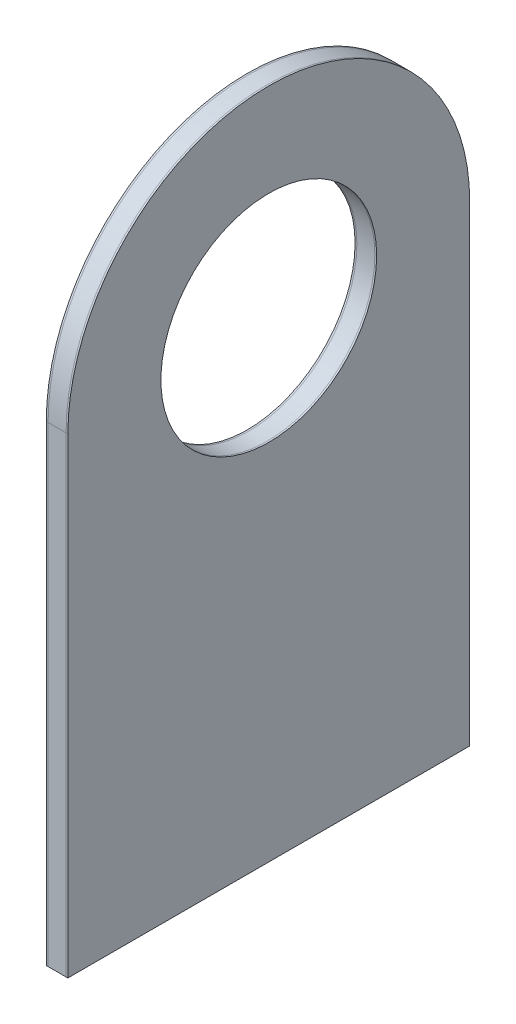
ISO-10303-21;
HEADER;
FILE_DESCRIPTION(('STEP AP214'),'2;1');
FILE_NAME('part.step','',(''),(''),'','','');
FILE_SCHEMA(('AUTOMOTIVE_DESIGN { 1 0 10303 214 1 1 1 1 }'));
ENDSEC;
DATA;
#1=APPLICATION_CONTEXT('core data for automotive mechanical design processes');
#2=APPLICATION_PROTOCOL_DEFINITION('international standard','automotive_design',2000,#1);
#3=PRODUCT_CONTEXT('',#1,'mechanical');
#4=PRODUCT('Part','Part','',(#3));
#5=PRODUCT_RELATED_PRODUCT_CATEGORY('part','',(#4));
#6=PRODUCT_DEFINITION_FORMATION('','',#4);
#7=PRODUCT_DEFINITION_CONTEXT('part definition',#1,'design');
#8=PRODUCT_DEFINITION('design','',#6,#7);
#9=PRODUCT_DEFINITION_SHAPE('','',#8);
#10=(LENGTH_UNIT() NAMED_UNIT(*) SI_UNIT(.MILLI.,.METRE.));
#11=(NAMED_UNIT(*) PLANE_ANGLE_UNIT() SI_UNIT($,.RADIAN.));
#12=(NAMED_UNIT(*) SI_UNIT($,.STERADIAN.) SOLID_ANGLE_UNIT());
#13=UNCERTAINTY_MEASURE_WITH_UNIT(LENGTH_MEASURE(1.E-05),#10,'distance_accuracy_value','');
#14=(GEOMETRIC_REPRESENTATION_CONTEXT(3) GLOBAL_UNCERTAINTY_ASSIGNED_CONTEXT((#13)) GLOBAL_UNIT_ASSIGNED_CONTEXT((#10,
#11,#12)) REPRESENTATION_CONTEXT('',''));
#15=CARTESIAN_POINT('',(0.,0.,0.));
#16=DIRECTION('',(0.,0.,1.));
#17=DIRECTION('',(1.,0.,0.));
#18=AXIS2_PLACEMENT_3D('',#15,#16,#17);
#19=CARTESIAN_POINT('',(3.,0.,0.));
#20=DIRECTION('',(0.,1.,0.));
#21=DIRECTION('',(0.,0.,1.));
#22=AXIS2_PLACEMENT_3D('',#19,#20,#21);
#23=PLANE('',#22);
#24=DIRECTION('',(0.,0.,-1.));
#25=VECTOR('',#24,1.);
#26=CARTESIAN_POINT('',(2.75,0.,0.));
#27=LINE('',#26,#25);
#28=CARTESIAN_POINT('',(2.75,0.,27.94));
#29=VERTEX_POINT('',#28);
#30=CARTESIAN_POINT('',(2.75,0.,-27.94));
#31=VERTEX_POINT('',#30);
#32=EDGE_CURVE('E127',#29,#31,#27,.T.);
#33=ORIENTED_EDGE('',*,*,#32,.T.);
#34=DIRECTION('',(-1.,0.,0.));
#35=VECTOR('',#34,1.);
#36=CARTESIAN_POINT('',(3.,0.,-27.94));
#37=LINE('',#36,#35);
#38=CARTESIAN_POINT('',(3.,0.,-27.94));
#39=VERTEX_POINT('',#38);
#40=EDGE_CURVE('E12',#39,#31,#37,.T.);
#41=ORIENTED_EDGE('',*,*,#40,.F.);
#42=DIRECTION('',(0.,0.,-1.));
#43=VECTOR('',#42,1.);
#44=CARTESIAN_POINT('',(3.,0.,0.));
#45=LINE('',#44,#43);
#46=CARTESIAN_POINT('',(3.,0.,27.94));
#47=VERTEX_POINT('',#46);
#48=EDGE_CURVE('E112',#47,#39,#45,.T.);
#49=ORIENTED_EDGE('',*,*,#48,.F.);
#50=DIRECTION('',(-1.,0.,0.));
#51=VECTOR('',#50,1.);
#52=CARTESIAN_POINT('',(3.,0.,27.94));
#53=LINE('',#52,#51);
#54=EDGE_CURVE('E126',#47,#29,#53,.T.);
#55=ORIENTED_EDGE('',*,*,#54,.T.);
#56=EDGE_LOOP('',(#33,#41,#49,#55));
#57=FACE_BOUND('',#56,.T.);
#58=ADVANCED_FACE('F60',(#57),#23,.F.);
#59=CARTESIAN_POINT('',(3.,0.,-27.94));
#60=DIRECTION('',(0.,0.,1.));
#61=DIRECTION('',(1.,0.,0.));
#62=AXIS2_PLACEMENT_3D('',#59,#60,#61);
#63=PLANE('',#62);
#64=DIRECTION('',(0.,1.,0.));
#65=VECTOR('',#64,1.);
#66=CARTESIAN_POINT('',(2.75,0.,-27.94));
#67=LINE('',#66,#65);
#68=CARTESIAN_POINT('',(2.75,65.532,-27.94));
#69=VERTEX_POINT('',#68);
#70=EDGE_CURVE('E116',#31,#69,#67,.T.);
#71=ORIENTED_EDGE('',*,*,#70,.T.);
#72=DIRECTION('',(-1.,0.,0.));
#73=VECTOR('',#72,1.);
#74=CARTESIAN_POINT('',(3.,65.532,-27.94));
#75=LINE('',#74,#73);
#76=CARTESIAN_POINT('',(3.,65.532,-27.94));
#77=VERTEX_POINT('',#76);
#78=EDGE_CURVE('E68',#77,#69,#75,.T.);
#79=ORIENTED_EDGE('',*,*,#78,.F.);
#80=DIRECTION('',(0.,1.,0.));
#81=VECTOR('',#80,1.);
#82=CARTESIAN_POINT('',(3.,0.,-27.94));
#83=LINE('',#82,#81);
#84=EDGE_CURVE('E106',#39,#77,#83,.T.);
#85=ORIENTED_EDGE('',*,*,#84,.F.);
#86=ORIENTED_EDGE('',*,*,#40,.T.);
#87=EDGE_LOOP('',(#71,#79,#85,#86));
#88=FACE_BOUND('',#87,.T.);
#89=ADVANCED_FACE('F115',(#88),#63,.F.);
#90=CARTESIAN_POINT('',(3.,65.532,0.));
#91=DIRECTION('',(-1.,0.,0.));
#92=DIRECTION('',(0.,0.,1.));
#93=AXIS2_PLACEMENT_3D('',#90,#91,#92);
#94=CYLINDRICAL_SURFACE('',#93,27.94);
#95=CARTESIAN_POINT('',(2.75,65.532,0.));
#96=DIRECTION('',(1.,0.,0.));
#97=DIRECTION('',(0.,0.,-1.));
#98=AXIS2_PLACEMENT_3D('',#95,#96,#97);
#99=CIRCLE('',#98,27.94);
#100=CARTESIAN_POINT('',(2.75,65.532,27.94));
#101=VERTEX_POINT('',#100);
#102=EDGE_CURVE('E93',#69,#101,#99,.T.);
#103=ORIENTED_EDGE('',*,*,#102,.T.);
#104=DIRECTION('',(-1.,0.,0.));
#105=VECTOR('',#104,1.);
#106=CARTESIAN_POINT('',(3.,65.532,27.94));
#107=LINE('',#106,#105);
#108=CARTESIAN_POINT('',(3.,65.532,27.94));
#109=VERTEX_POINT('',#108);
#110=EDGE_CURVE('E117',#109,#101,#107,.T.);
#111=ORIENTED_EDGE('',*,*,#110,.F.);
#112=CARTESIAN_POINT('',(3.,65.532,0.));
#113=DIRECTION('',(1.,0.,0.));
#114=DIRECTION('',(0.,0.,-1.));
#115=AXIS2_PLACEMENT_3D('',#112,#113,#114);
#116=CIRCLE('',#115,27.94);
#117=EDGE_CURVE('E110',#77,#109,#116,.T.);
#118=ORIENTED_EDGE('',*,*,#117,.F.);
#119=ORIENTED_EDGE('',*,*,#78,.T.);
#120=EDGE_LOOP('',(#103,#111,#118,#119));
#121=FACE_BOUND('',#120,.T.);
#122=ADVANCED_FACE('F118',(#121),#94,.T.);
#123=CARTESIAN_POINT('',(3.,0.,27.94));
#124=DIRECTION('',(0.,0.,-1.));
#125=DIRECTION('',(-1.,0.,0.));
#126=AXIS2_PLACEMENT_3D('',#123,#124,#125);
#127=PLANE('',#126);
#128=DIRECTION('',(0.,-1.,0.));
#129=VECTOR('',#128,1.);
#130=CARTESIAN_POINT('',(2.75,0.,27.94));
#131=LINE('',#130,#129);
#132=EDGE_CURVE('E99',#101,#29,#131,.T.);
#133=ORIENTED_EDGE('',*,*,#132,.T.);
#134=ORIENTED_EDGE('',*,*,#54,.F.);
#135=DIRECTION('',(0.,-1.,0.));
#136=VECTOR('',#135,1.);
#137=CARTESIAN_POINT('',(3.,0.,27.94));
#138=LINE('',#137,#136);
#139=EDGE_CURVE('E76',#109,#47,#138,.T.);
#140=ORIENTED_EDGE('',*,*,#139,.F.);
#141=ORIENTED_EDGE('',*,*,#110,.T.);
#142=EDGE_LOOP('',(#133,#134,#140,#141));
#143=FACE_BOUND('',#142,.T.);
#144=ADVANCED_FACE('F137',(#143),#127,.F.);
#145=CARTESIAN_POINT('',(3.,65.532,0.));
#146=DIRECTION('',(-1.,0.,0.));
#147=DIRECTION('',(0.,0.,1.));
#148=AXIS2_PLACEMENT_3D('',#145,#146,#147);
#149=CYLINDRICAL_SURFACE('',#148,15.);
#150=CARTESIAN_POINT('',(3.,65.532,0.));
#151=DIRECTION('',(1.,0.,0.));
#152=DIRECTION('',(0.,0.,-1.));
#153=AXIS2_PLACEMENT_3D('',#150,#151,#152);
#154=CIRCLE('',#153,15.);
#155=CARTESIAN_POINT('',(3.,65.532,-15.));
#156=VERTEX_POINT('',#155);
#157=EDGE_CURVE('E120',#156,#156,#154,.F.);
#158=ORIENTED_EDGE('',*,*,#157,.F.);
#159=EDGE_LOOP('',(#158));
#160=FACE_BOUND('',#159,.T.);
#161=CARTESIAN_POINT('',(2.75,65.532,0.));
#162=DIRECTION('',(1.,0.,0.));
#163=DIRECTION('',(0.,0.,-1.));
#164=AXIS2_PLACEMENT_3D('',#161,#162,#163);
#165=CIRCLE('',#164,15.);
#166=CARTESIAN_POINT('',(2.75,65.532,-15.));
#167=VERTEX_POINT('',#166);
#168=EDGE_CURVE('E133',#167,#167,#165,.F.);
#169=ORIENTED_EDGE('',*,*,#168,.T.);
#170=EDGE_LOOP('',(#169));
#171=FACE_BOUND('',#170,.T.);
#172=ADVANCED_FACE('F154',(#160,#171),#149,.F.);
#173=CARTESIAN_POINT('',(3.,0.,0.));
#174=DIRECTION('',(1.,0.,0.));
#175=DIRECTION('',(0.,0.,-1.));
#176=AXIS2_PLACEMENT_3D('',#173,#174,#175);
#177=PLANE('',#176);
#178=ORIENTED_EDGE('',*,*,#48,.T.);
#179=ORIENTED_EDGE('',*,*,#84,.T.);
#180=ORIENTED_EDGE('',*,*,#117,.T.);
#181=ORIENTED_EDGE('',*,*,#139,.T.);
#182=EDGE_LOOP('',(#178,#179,#180,#181));
#183=FACE_BOUND('',#182,.T.);
#184=ORIENTED_EDGE('',*,*,#157,.T.);
#185=EDGE_LOOP('',(#184));
#186=FACE_BOUND('',#185,.T.);
#187=ADVANCED_FACE('F107',(#183,#186),#177,.T.);
#188=CARTESIAN_POINT('',(2.75,0.,0.));
#189=DIRECTION('',(1.,0.,0.));
#190=DIRECTION('',(0.,0.,-1.));
#191=AXIS2_PLACEMENT_3D('',#188,#189,#190);
#192=PLANE('',#191);
#193=ORIENTED_EDGE('',*,*,#32,.F.);
#194=ORIENTED_EDGE('',*,*,#132,.F.);
#195=ORIENTED_EDGE('',*,*,#102,.F.);
#196=ORIENTED_EDGE('',*,*,#70,.F.);
#197=EDGE_LOOP('',(#193,#194,#195,#196));
#198=FACE_BOUND('',#197,.T.);
#199=ORIENTED_EDGE('',*,*,#168,.F.);
#200=EDGE_LOOP('',(#199));
#201=FACE_BOUND('',#200,.T.);
#202=ADVANCED_FACE('F140',(#198,#201),#192,.F.);
#203=CLOSED_SHELL('',(#58,#89,#122,#144,#172,#187,#202));
#204=MANIFOLD_SOLID_BREP('B2',#203);
#205=CARTESIAN_POINT('',(2.75,0.,-27.94));
#206=DIRECTION('',(0.,0.,1.));
#207=DIRECTION('',(1.,0.,0.));
#208=AXIS2_PLACEMENT_3D('',#205,#206,#207);
#209=PLANE('',#208);
#210=DIRECTION('',(0.,1.,0.));
#211=VECTOR('',#210,1.);
#212=CARTESIAN_POINT('',(0.25,0.,-27.94));
#213=LINE('',#212,#211);
#214=CARTESIAN_POINT('',(0.25,0.,-27.94));
#215=VERTEX_POINT('',#214);
#216=CARTESIAN_POINT('',(0.25,65.532,-27.94));
#217=VERTEX_POINT('',#216);
#218=EDGE_CURVE('E290',#215,#217,#213,.T.);
#219=ORIENTED_EDGE('',*,*,#218,.T.);
#220=DIRECTION('',(-1.,0.,0.));
#221=VECTOR('',#220,1.);
#222=CARTESIAN_POINT('',(2.75,65.532,-27.94));
#223=LINE('',#222,#221);
#224=CARTESIAN_POINT('',(2.75,65.532,-27.94));
#225=VERTEX_POINT('',#224);
#226=EDGE_CURVE('E58',#225,#217,#223,.T.);
#227=ORIENTED_EDGE('',*,*,#226,.F.);
#228=DIRECTION('',(0.,1.,0.));
#229=VECTOR('',#228,1.);
#230=CARTESIAN_POINT('',(2.75,0.,-27.94));
#231=LINE('',#230,#229);
#232=CARTESIAN_POINT('',(2.75,0.,-27.94));
#233=VERTEX_POINT('',#232);
#234=EDGE_CURVE('E270',#233,#225,#231,.T.);
#235=ORIENTED_EDGE('',*,*,#234,.F.);
#236=DIRECTION('',(-1.,0.,0.));
#237=VECTOR('',#236,1.);
#238=CARTESIAN_POINT('',(2.75,0.,-27.94));
#239=LINE('',#238,#237);
#240=EDGE_CURVE('E282',#233,#215,#239,.T.);
#241=ORIENTED_EDGE('',*,*,#240,.T.);
#242=EDGE_LOOP('',(#219,#227,#235,#241));
#243=FACE_BOUND('',#242,.T.);
#244=ADVANCED_FACE('F217',(#243),#209,.F.);
#245=CARTESIAN_POINT('',(2.75,65.532,0.));
#246=DIRECTION('',(-1.,0.,0.));
#247=DIRECTION('',(0.,0.,1.));
#248=AXIS2_PLACEMENT_3D('',#245,#246,#247);
#249=CYLINDRICAL_SURFACE('',#248,27.94);
#250=CARTESIAN_POINT('',(0.25,65.532,0.));
#251=DIRECTION('',(1.,0.,0.));
#252=DIRECTION('',(0.,0.,-1.));
#253=AXIS2_PLACEMENT_3D('',#250,#251,#252);
#254=CIRCLE('',#253,27.94);
#255=CARTESIAN_POINT('',(0.25,65.532,27.94));
#256=VERTEX_POINT('',#255);
#257=EDGE_CURVE('E275',#217,#256,#254,.T.);
#258=ORIENTED_EDGE('',*,*,#257,.T.);
#259=DIRECTION('',(-1.,0.,0.));
#260=VECTOR('',#259,1.);
#261=CARTESIAN_POINT('',(2.75,65.532,27.94));
#262=LINE('',#261,#260);
#263=CARTESIAN_POINT('',(2.75,65.532,27.94));
#264=VERTEX_POINT('',#263);
#265=EDGE_CURVE('E227',#264,#256,#262,.T.);
#266=ORIENTED_EDGE('',*,*,#265,.F.);
#267=CARTESIAN_POINT('',(2.75,65.532,0.));
#268=DIRECTION('',(1.,0.,0.));
#269=DIRECTION('',(0.,0.,-1.));
#270=AXIS2_PLACEMENT_3D('',#267,#268,#269);
#271=CIRCLE('',#270,27.94);
#272=EDGE_CURVE('E265',#225,#264,#271,.T.);
#273=ORIENTED_EDGE('',*,*,#272,.F.);
#274=ORIENTED_EDGE('',*,*,#226,.T.);
#275=EDGE_LOOP('',(#258,#266,#273,#274));
#276=FACE_BOUND('',#275,.T.);
#277=ADVANCED_FACE('F274',(#276),#249,.T.);
#278=CARTESIAN_POINT('',(2.75,0.,27.94));
#279=DIRECTION('',(0.,0.,-1.));
#280=DIRECTION('',(-1.,0.,0.));
#281=AXIS2_PLACEMENT_3D('',#278,#279,#280);
#282=PLANE('',#281);
#283=DIRECTION('',(0.,-1.,0.));
#284=VECTOR('',#283,1.);
#285=CARTESIAN_POINT('',(0.25,0.,27.94));
#286=LINE('',#285,#284);
#287=CARTESIAN_POINT('',(0.25,0.,27.94));
#288=VERTEX_POINT('',#287);
#289=EDGE_CURVE('E252',#256,#288,#286,.T.);
#290=ORIENTED_EDGE('',*,*,#289,.T.);
#291=DIRECTION('',(-1.,0.,0.));
#292=VECTOR('',#291,1.);
#293=CARTESIAN_POINT('',(2.75,0.,27.94));
#294=LINE('',#293,#292);
#295=CARTESIAN_POINT('',(2.75,0.,27.94));
#296=VERTEX_POINT('',#295);
#297=EDGE_CURVE('E277',#296,#288,#294,.T.);
#298=ORIENTED_EDGE('',*,*,#297,.F.);
#299=DIRECTION('',(0.,-1.,0.));
#300=VECTOR('',#299,1.);
#301=CARTESIAN_POINT('',(2.75,0.,27.94));
#302=LINE('',#301,#300);
#303=EDGE_CURVE('E268',#264,#296,#302,.T.);
#304=ORIENTED_EDGE('',*,*,#303,.F.);
#305=ORIENTED_EDGE('',*,*,#265,.T.);
#306=EDGE_LOOP('',(#290,#298,#304,#305));
#307=FACE_BOUND('',#306,.T.);
#308=ADVANCED_FACE('F278',(#307),#282,.F.);
#309=CARTESIAN_POINT('',(2.75,65.532,0.));
#310=DIRECTION('',(-1.,0.,0.));
#311=DIRECTION('',(0.,0.,1.));
#312=AXIS2_PLACEMENT_3D('',#309,#310,#311);
#313=CYLINDRICAL_SURFACE('',#312,15.);
#314=CARTESIAN_POINT('',(2.75,65.532,0.));
#315=DIRECTION('',(1.,0.,0.));
#316=DIRECTION('',(0.,0.,-1.));
#317=AXIS2_PLACEMENT_3D('',#314,#315,#316);
#318=CIRCLE('',#317,15.);
#319=CARTESIAN_POINT('',(2.75,65.532,-15.));
#320=VERTEX_POINT('',#319);
#321=EDGE_CURVE('E300',#320,#320,#318,.F.);
#322=ORIENTED_EDGE('',*,*,#321,.F.);
#323=EDGE_LOOP('',(#322));
#324=FACE_BOUND('',#323,.T.);
#325=CARTESIAN_POINT('',(0.25,65.532,0.));
#326=DIRECTION('',(1.,0.,0.));
#327=DIRECTION('',(0.,0.,-1.));
#328=AXIS2_PLACEMENT_3D('',#325,#326,#327);
#329=CIRCLE('',#328,15.);
#330=CARTESIAN_POINT('',(0.25,65.532,-15.));
#331=VERTEX_POINT('',#330);
#332=EDGE_CURVE('E286',#331,#331,#329,.F.);
#333=ORIENTED_EDGE('',*,*,#332,.T.);
#334=EDGE_LOOP('',(#333));
#335=FACE_BOUND('',#334,.T.);
#336=ADVANCED_FACE('F219',(#324,#335),#313,.F.);
#337=CARTESIAN_POINT('',(2.75,0.,0.));
#338=DIRECTION('',(0.,1.,0.));
#339=DIRECTION('',(0.,0.,1.));
#340=AXIS2_PLACEMENT_3D('',#337,#338,#339);
#341=PLANE('',#340);
#342=DIRECTION('',(0.,0.,-1.));
#343=VECTOR('',#342,1.);
#344=CARTESIAN_POINT('',(0.25,0.,0.));
#345=LINE('',#344,#343);
#346=EDGE_CURVE('E258',#288,#215,#345,.T.);
#347=ORIENTED_EDGE('',*,*,#346,.T.);
#348=ORIENTED_EDGE('',*,*,#240,.F.);
#349=DIRECTION('',(0.,0.,-1.));
#350=VECTOR('',#349,1.);
#351=CARTESIAN_POINT('',(2.75,0.,0.));
#352=LINE('',#351,#350);
#353=EDGE_CURVE('E235',#296,#233,#352,.T.);
#354=ORIENTED_EDGE('',*,*,#353,.F.);
#355=ORIENTED_EDGE('',*,*,#297,.T.);
#356=EDGE_LOOP('',(#347,#348,#354,#355));
#357=FACE_BOUND('',#356,.T.);
#358=ADVANCED_FACE('F304',(#357),#341,.F.);
#359=CARTESIAN_POINT('',(2.75,0.,0.));
#360=DIRECTION('',(1.,0.,0.));
#361=DIRECTION('',(0.,0.,-1.));
#362=AXIS2_PLACEMENT_3D('',#359,#360,#361);
#363=PLANE('',#362);
#364=ORIENTED_EDGE('',*,*,#321,.T.);
#365=EDGE_LOOP('',(#364));
#366=FACE_BOUND('',#365,.T.);
#367=ORIENTED_EDGE('',*,*,#234,.T.);
#368=ORIENTED_EDGE('',*,*,#272,.T.);
#369=ORIENTED_EDGE('',*,*,#303,.T.);
#370=ORIENTED_EDGE('',*,*,#353,.T.);
#371=EDGE_LOOP('',(#367,#368,#369,#370));
#372=FACE_BOUND('',#371,.T.);
#373=ADVANCED_FACE('F266',(#366,#372),#363,.T.);
#374=CARTESIAN_POINT('',(0.25,0.,0.));
#375=DIRECTION('',(1.,0.,0.));
#376=DIRECTION('',(0.,0.,-1.));
#377=AXIS2_PLACEMENT_3D('',#374,#375,#376);
#378=PLANE('',#377);
#379=ORIENTED_EDGE('',*,*,#332,.F.);
#380=EDGE_LOOP('',(#379));
#381=FACE_BOUND('',#380,.T.);
#382=ORIENTED_EDGE('',*,*,#218,.F.);
#383=ORIENTED_EDGE('',*,*,#346,.F.);
#384=ORIENTED_EDGE('',*,*,#289,.F.);
#385=ORIENTED_EDGE('',*,*,#257,.F.);
#386=EDGE_LOOP('',(#382,#383,#384,#385));
#387=FACE_BOUND('',#386,.T.);
#388=ADVANCED_FACE('F307',(#381,#387),#378,.F.);
#389=CLOSED_SHELL('',(#244,#277,#308,#336,#358,#373,#388));
#390=MANIFOLD_SOLID_BREP('B6',#389);
#391=CARTESIAN_POINT('',(0.25,65.532,0.));
#392=DIRECTION('',(1.,0.,0.));
#393=DIRECTION('',(0.,0.,-1.));
#394=AXIS2_PLACEMENT_3D('',#391,#392,#393);
#395=PLANE('',#394);
#396=CARTESIAN_POINT('',(0.25,65.532,0.));
#397=DIRECTION('',(1.,0.,0.));
#398=DIRECTION('',(0.,0.,-1.));
#399=AXIS2_PLACEMENT_3D('',#396,#397,#398);
#400=CIRCLE('',#399,27.94);
#401=CARTESIAN_POINT('',(0.25,65.532,-27.94));
#402=VERTEX_POINT('',#401);
#403=CARTESIAN_POINT('',(0.25,65.532,27.94));
#404=VERTEX_POINT('',#403);
#405=EDGE_CURVE('E431',#402,#404,#400,.T.);
#406=ORIENTED_EDGE('',*,*,#405,.T.);
#407=DIRECTION('',(0.,-1.,0.));
#408=VECTOR('',#407,1.);
#409=CARTESIAN_POINT('',(0.25,65.532,27.94));
#410=LINE('',#409,#408);
#411=CARTESIAN_POINT('',(0.25,0.,27.94));
#412=VERTEX_POINT('',#411);
#413=EDGE_CURVE('E426',#404,#412,#410,.T.);
#414=ORIENTED_EDGE('',*,*,#413,.T.);
#415=DIRECTION('',(0.,0.,-1.));
#416=VECTOR('',#415,1.);
#417=CARTESIAN_POINT('',(0.25,0.,27.94));
#418=LINE('',#417,#416);
#419=CARTESIAN_POINT('',(0.25,0.,-27.94));
#420=VERTEX_POINT('',#419);
#421=EDGE_CURVE('E429',#412,#420,#418,.T.);
#422=ORIENTED_EDGE('',*,*,#421,.T.);
#423=DIRECTION('',(0.,1.,0.));
#424=VECTOR('',#423,1.);
#425=CARTESIAN_POINT('',(0.25,0.,-27.94));
#426=LINE('',#425,#424);
#427=EDGE_CURVE('E396',#420,#402,#426,.T.);
#428=ORIENTED_EDGE('',*,*,#427,.T.);
#429=EDGE_LOOP('',(#406,#414,#422,#428));
#430=FACE_BOUND('',#429,.T.);
#431=CARTESIAN_POINT('',(0.25,65.532,0.));
#432=DIRECTION('',(1.,0.,0.));
#433=DIRECTION('',(0.,0.,-1.));
#434=AXIS2_PLACEMENT_3D('',#431,#432,#433);
#435=CIRCLE('',#434,15.);
#436=CARTESIAN_POINT('',(0.25,65.532,-15.));
#437=VERTEX_POINT('',#436);
#438=EDGE_CURVE('E446',#437,#437,#435,.T.);
#439=ORIENTED_EDGE('',*,*,#438,.F.);
#440=EDGE_LOOP('',(#439));
#441=FACE_BOUND('',#440,.T.);
#442=ADVANCED_FACE('F379',(#430,#441),#395,.T.);
#443=CARTESIAN_POINT('',(0.,65.532,0.));
#444=DIRECTION('',(1.,0.,0.));
#445=DIRECTION('',(0.,0.,-1.));
#446=AXIS2_PLACEMENT_3D('',#443,#444,#445);
#447=PLANE('',#446);
#448=CARTESIAN_POINT('',(0.,65.532,0.));
#449=DIRECTION('',(1.,0.,0.));
#450=DIRECTION('',(0.,0.,-1.));
#451=AXIS2_PLACEMENT_3D('',#448,#449,#450);
#452=CIRCLE('',#451,27.94);
#453=CARTESIAN_POINT('',(0.,65.532,-27.94));
#454=VERTEX_POINT('',#453);
#455=CARTESIAN_POINT('',(0.,65.532,27.94));
#456=VERTEX_POINT('',#455);
#457=EDGE_CURVE('E443',#454,#456,#452,.T.);
#458=ORIENTED_EDGE('',*,*,#457,.F.);
#459=DIRECTION('',(0.,1.,0.));
#460=VECTOR('',#459,1.);
#461=CARTESIAN_POINT('',(0.,0.,-27.94));
#462=LINE('',#461,#460);
#463=CARTESIAN_POINT('',(0.,0.,-27.94));
#464=VERTEX_POINT('',#463);
#465=EDGE_CURVE('E419',#464,#454,#462,.T.);
#466=ORIENTED_EDGE('',*,*,#465,.F.);
#467=DIRECTION('',(0.,0.,-1.));
#468=VECTOR('',#467,1.);
#469=CARTESIAN_POINT('',(0.,0.,27.94));
#470=LINE('',#469,#468);
#471=CARTESIAN_POINT('',(0.,0.,27.94));
#472=VERTEX_POINT('',#471);
#473=EDGE_CURVE('E413',#472,#464,#470,.T.);
#474=ORIENTED_EDGE('',*,*,#473,.F.);
#475=DIRECTION('',(0.,-1.,0.));
#476=VECTOR('',#475,1.);
#477=CARTESIAN_POINT('',(0.,65.532,27.94));
#478=LINE('',#477,#476);
#479=EDGE_CURVE('E435',#456,#472,#478,.T.);
#480=ORIENTED_EDGE('',*,*,#479,.F.);
#481=EDGE_LOOP('',(#458,#466,#474,#480));
#482=FACE_BOUND('',#481,.T.);
#483=CARTESIAN_POINT('',(0.,65.532,0.));
#484=DIRECTION('',(1.,0.,0.));
#485=DIRECTION('',(0.,0.,-1.));
#486=AXIS2_PLACEMENT_3D('',#483,#484,#485);
#487=CIRCLE('',#486,15.);
#488=CARTESIAN_POINT('',(0.,65.532,-15.));
#489=VERTEX_POINT('',#488);
#490=EDGE_CURVE('E458',#489,#489,#487,.T.);
#491=ORIENTED_EDGE('',*,*,#490,.T.);
#492=EDGE_LOOP('',(#491));
#493=FACE_BOUND('',#492,.T.);
#494=ADVANCED_FACE('F454',(#482,#493),#447,.F.);
#495=CARTESIAN_POINT('',(0.25,65.532,0.));
#496=DIRECTION('',(-1.,0.,0.));
#497=DIRECTION('',(0.,0.,1.));
#498=AXIS2_PLACEMENT_3D('',#495,#496,#497);
#499=CYLINDRICAL_SURFACE('',#498,27.94);
#500=ORIENTED_EDGE('',*,*,#457,.T.);
#501=DIRECTION('',(-1.,0.,0.));
#502=VECTOR('',#501,1.);
#503=CARTESIAN_POINT('',(0.25,65.532,27.94));
#504=LINE('',#503,#502);
#505=EDGE_CURVE('E215',#404,#456,#504,.T.);
#506=ORIENTED_EDGE('',*,*,#505,.F.);
#507=ORIENTED_EDGE('',*,*,#405,.F.);
#508=DIRECTION('',(-1.,0.,0.));
#509=VECTOR('',#508,1.);
#510=CARTESIAN_POINT('',(0.25,65.532,-27.94));
#511=LINE('',#510,#509);
#512=EDGE_CURVE('E439',#402,#454,#511,.T.);
#513=ORIENTED_EDGE('',*,*,#512,.T.);
#514=EDGE_LOOP('',(#500,#506,#507,#513));
#515=FACE_BOUND('',#514,.T.);
#516=ADVANCED_FACE('F381',(#515),#499,.T.);
#517=CARTESIAN_POINT('',(0.25,65.532,27.94));
#518=DIRECTION('',(0.,0.,-1.));
#519=DIRECTION('',(-1.,0.,0.));
#520=AXIS2_PLACEMENT_3D('',#517,#518,#519);
#521=PLANE('',#520);
#522=ORIENTED_EDGE('',*,*,#479,.T.);
#523=DIRECTION('',(-1.,0.,0.));
#524=VECTOR('',#523,1.);
#525=CARTESIAN_POINT('',(0.25,0.,27.94));
#526=LINE('',#525,#524);
#527=EDGE_CURVE('E388',#412,#472,#526,.T.);
#528=ORIENTED_EDGE('',*,*,#527,.F.);
#529=ORIENTED_EDGE('',*,*,#413,.F.);
#530=ORIENTED_EDGE('',*,*,#505,.T.);
#531=EDGE_LOOP('',(#522,#528,#529,#530));
#532=FACE_BOUND('',#531,.T.);
#533=ADVANCED_FACE('F434',(#532),#521,.F.);
#534=CARTESIAN_POINT('',(0.25,0.,27.94));
#535=DIRECTION('',(0.,1.,0.));
#536=DIRECTION('',(0.,0.,1.));
#537=AXIS2_PLACEMENT_3D('',#534,#535,#536);
#538=PLANE('',#537);
#539=ORIENTED_EDGE('',*,*,#473,.T.);
#540=DIRECTION('',(-1.,0.,0.));
#541=VECTOR('',#540,1.);
#542=CARTESIAN_POINT('',(0.25,0.,-27.94));
#543=LINE('',#542,#541);
#544=EDGE_CURVE('E436',#420,#464,#543,.T.);
#545=ORIENTED_EDGE('',*,*,#544,.F.);
#546=ORIENTED_EDGE('',*,*,#421,.F.);
#547=ORIENTED_EDGE('',*,*,#527,.T.);
#548=EDGE_LOOP('',(#539,#545,#546,#547));
#549=FACE_BOUND('',#548,.T.);
#550=ADVANCED_FACE('F437',(#549),#538,.F.);
#551=CARTESIAN_POINT('',(0.25,0.,-27.94));
#552=DIRECTION('',(0.,0.,1.));
#553=DIRECTION('',(1.,0.,0.));
#554=AXIS2_PLACEMENT_3D('',#551,#552,#553);
#555=PLANE('',#554);
#556=ORIENTED_EDGE('',*,*,#465,.T.);
#557=ORIENTED_EDGE('',*,*,#512,.F.);
#558=ORIENTED_EDGE('',*,*,#427,.F.);
#559=ORIENTED_EDGE('',*,*,#544,.T.);
#560=EDGE_LOOP('',(#556,#557,#558,#559));
#561=FACE_BOUND('',#560,.T.);
#562=ADVANCED_FACE('F451',(#561),#555,.F.);
#563=CARTESIAN_POINT('',(0.25,65.532,0.));
#564=DIRECTION('',(-1.,0.,0.));
#565=DIRECTION('',(0.,0.,1.));
#566=AXIS2_PLACEMENT_3D('',#563,#564,#565);
#567=CYLINDRICAL_SURFACE('',#566,15.);
#568=ORIENTED_EDGE('',*,*,#438,.T.);
#569=EDGE_LOOP('',(#568));
#570=FACE_BOUND('',#569,.T.);
#571=ORIENTED_EDGE('',*,*,#490,.F.);
#572=EDGE_LOOP('',(#571));
#573=FACE_BOUND('',#572,.T.);
#574=ADVANCED_FACE('F464',(#570,#573),#567,.F.);
#575=CLOSED_SHELL('',(#442,#494,#516,#533,#550,#562,#574));
#576=MANIFOLD_SOLID_BREP('B52',#575);
#577=ADVANCED_BREP_SHAPE_REPRESENTATION('',(#18,#204,#390,#576),#14);
#578=SHAPE_DEFINITION_REPRESENTATION(#9,#577);
ENDSEC;
END-ISO-10303-21;
